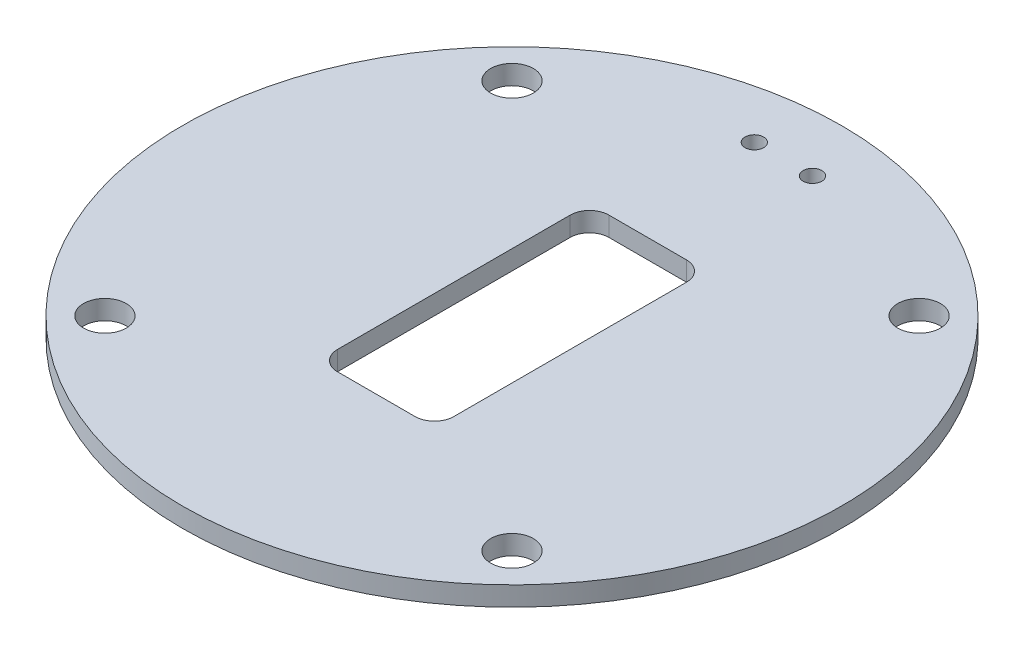
ISO-10303-21;
HEADER;
FILE_DESCRIPTION(('STEP AP214'),'2;1');
FILE_NAME('part.step','',(''),(''),'','','');
FILE_SCHEMA(('AUTOMOTIVE_DESIGN { 1 0 10303 214 1 1 1 1 }'));
ENDSEC;
DATA;
#1=APPLICATION_CONTEXT('core data for automotive mechanical design processes');
#2=APPLICATION_PROTOCOL_DEFINITION('international standard','automotive_design',2000,#1);
#3=PRODUCT_CONTEXT('',#1,'mechanical');
#4=PRODUCT('Part','Part','',(#3));
#5=PRODUCT_RELATED_PRODUCT_CATEGORY('part','',(#4));
#6=PRODUCT_DEFINITION_FORMATION('','',#4);
#7=PRODUCT_DEFINITION_CONTEXT('part definition',#1,'design');
#8=PRODUCT_DEFINITION('design','',#6,#7);
#9=PRODUCT_DEFINITION_SHAPE('','',#8);
#10=(LENGTH_UNIT() NAMED_UNIT(*) SI_UNIT(.MILLI.,.METRE.));
#11=(NAMED_UNIT(*) PLANE_ANGLE_UNIT() SI_UNIT($,.RADIAN.));
#12=(NAMED_UNIT(*) SI_UNIT($,.STERADIAN.) SOLID_ANGLE_UNIT());
#13=UNCERTAINTY_MEASURE_WITH_UNIT(LENGTH_MEASURE(1.E-05),#10,'distance_accuracy_value','');
#14=(GEOMETRIC_REPRESENTATION_CONTEXT(3) GLOBAL_UNCERTAINTY_ASSIGNED_CONTEXT((#13)) GLOBAL_UNIT_ASSIGNED_CONTEXT((#10,
#11,#12)) REPRESENTATION_CONTEXT('',''));
#15=CARTESIAN_POINT('',(0.,0.,0.));
#16=DIRECTION('',(0.,0.,1.));
#17=DIRECTION('',(1.,0.,0.));
#18=AXIS2_PLACEMENT_3D('',#15,#16,#17);
#19=CARTESIAN_POINT('',(0.,5.,0.));
#20=DIRECTION('',(0.,-1.,0.));
#21=DIRECTION('',(0.,0.,-1.));
#22=AXIS2_PLACEMENT_3D('',#19,#20,#21);
#23=CYLINDRICAL_SURFACE('',#22,85.);
#24=CARTESIAN_POINT('',(0.,5.,0.));
#25=DIRECTION('',(0.,1.,0.));
#26=DIRECTION('',(0.,0.,1.));
#27=AXIS2_PLACEMENT_3D('',#24,#25,#26);
#28=CIRCLE('',#27,85.);
#29=CARTESIAN_POINT('',(0.,5.,85.));
#30=VERTEX_POINT('',#29);
#31=EDGE_CURVE('E11',#30,#30,#28,.T.);
#32=ORIENTED_EDGE('',*,*,#31,.F.);
#33=EDGE_LOOP('',(#32));
#34=FACE_BOUND('',#33,.T.);
#35=CARTESIAN_POINT('',(0.,0.,0.));
#36=DIRECTION('',(0.,1.,0.));
#37=DIRECTION('',(0.,0.,1.));
#38=AXIS2_PLACEMENT_3D('',#35,#36,#37);
#39=CIRCLE('',#38,85.);
#40=CARTESIAN_POINT('',(0.,0.,85.));
#41=VERTEX_POINT('',#40);
#42=EDGE_CURVE('E37',#41,#41,#39,.T.);
#43=ORIENTED_EDGE('',*,*,#42,.T.);
#44=EDGE_LOOP('',(#43));
#45=FACE_BOUND('',#44,.T.);
#46=ADVANCED_FACE('F34',(#34,#45),#23,.T.);
#47=CARTESIAN_POINT('',(0.,5.,0.));
#48=DIRECTION('',(0.,1.,0.));
#49=DIRECTION('',(0.,0.,1.));
#50=AXIS2_PLACEMENT_3D('',#47,#48,#49);
#51=PLANE('',#50);
#52=CARTESIAN_POINT('',(7.5,5.,-70.));
#53=DIRECTION('',(0.,1.,0.));
#54=DIRECTION('',(0.,0.,1.));
#55=AXIS2_PLACEMENT_3D('',#52,#53,#54);
#56=CIRCLE('',#55,2.4);
#57=CARTESIAN_POINT('',(7.5,5.,-67.6));
#58=VERTEX_POINT('',#57);
#59=EDGE_CURVE('E376',#58,#58,#56,.T.);
#60=ORIENTED_EDGE('',*,*,#59,.F.);
#61=EDGE_LOOP('',(#60));
#62=FACE_BOUND('',#61,.T.);
#63=CARTESIAN_POINT('',(-7.5,5.,-70.));
#64=DIRECTION('',(0.,1.,0.));
#65=DIRECTION('',(0.,0.,-1.));
#66=AXIS2_PLACEMENT_3D('',#63,#64,#65);
#67=CIRCLE('',#66,2.4);
#68=CARTESIAN_POINT('',(-7.5,5.,-72.4));
#69=VERTEX_POINT('',#68);
#70=EDGE_CURVE('E395',#69,#69,#67,.T.);
#71=ORIENTED_EDGE('',*,*,#70,.F.);
#72=EDGE_LOOP('',(#71));
#73=FACE_BOUND('',#72,.T.);
#74=CARTESIAN_POINT('',(9.99999999999999,5.,-30.));
#75=DIRECTION('',(0.,1.,0.));
#76=DIRECTION('',(0.,0.,1.));
#77=AXIS2_PLACEMENT_3D('',#74,#75,#76);
#78=CIRCLE('',#77,5.);
#79=CARTESIAN_POINT('',(15.,5.,-30.));
#80=VERTEX_POINT('',#79);
#81=CARTESIAN_POINT('',(9.99999999999999,5.,-35.));
#82=VERTEX_POINT('',#81);
#83=EDGE_CURVE('E48',#80,#82,#78,.T.);
#84=ORIENTED_EDGE('',*,*,#83,.F.);
#85=DIRECTION('',(0.,0.,-1.));
#86=VECTOR('',#85,1.);
#87=CARTESIAN_POINT('',(15.,5.,30.));
#88=LINE('',#87,#86);
#89=CARTESIAN_POINT('',(15.,5.,30.));
#90=VERTEX_POINT('',#89);
#91=EDGE_CURVE('E106',#90,#80,#88,.T.);
#92=ORIENTED_EDGE('',*,*,#91,.F.);
#93=CARTESIAN_POINT('',(9.99999999999999,5.,30.));
#94=DIRECTION('',(0.,1.,0.));
#95=DIRECTION('',(0.,0.,1.));
#96=AXIS2_PLACEMENT_3D('',#93,#94,#95);
#97=CIRCLE('',#96,5.);
#98=CARTESIAN_POINT('',(9.99999999999999,5.,35.));
#99=VERTEX_POINT('',#98);
#100=EDGE_CURVE('E140',#99,#90,#97,.T.);
#101=ORIENTED_EDGE('',*,*,#100,.F.);
#102=DIRECTION('',(1.,0.,0.));
#103=VECTOR('',#102,1.);
#104=CARTESIAN_POINT('',(9.99999999999999,5.,35.));
#105=LINE('',#104,#103);
#106=CARTESIAN_POINT('',(-10.,5.,35.));
#107=VERTEX_POINT('',#106);
#108=EDGE_CURVE('E137',#107,#99,#105,.T.);
#109=ORIENTED_EDGE('',*,*,#108,.F.);
#110=CARTESIAN_POINT('',(-10.,5.,30.));
#111=DIRECTION('',(0.,1.,0.));
#112=DIRECTION('',(0.,0.,-1.));
#113=AXIS2_PLACEMENT_3D('',#110,#111,#112);
#114=CIRCLE('',#113,4.99999999999999);
#115=CARTESIAN_POINT('',(-15.,5.,30.));
#116=VERTEX_POINT('',#115);
#117=EDGE_CURVE('E134',#116,#107,#114,.T.);
#118=ORIENTED_EDGE('',*,*,#117,.F.);
#119=DIRECTION('',(0.,0.,1.));
#120=VECTOR('',#119,1.);
#121=CARTESIAN_POINT('',(-15.,5.,30.));
#122=LINE('',#121,#120);
#123=CARTESIAN_POINT('',(-15.,5.,-30.));
#124=VERTEX_POINT('',#123);
#125=EDGE_CURVE('E131',#124,#116,#122,.T.);
#126=ORIENTED_EDGE('',*,*,#125,.F.);
#127=CARTESIAN_POINT('',(-10.,5.,-30.));
#128=DIRECTION('',(0.,1.,0.));
#129=DIRECTION('',(0.,0.,1.));
#130=AXIS2_PLACEMENT_3D('',#127,#128,#129);
#131=CIRCLE('',#130,5.);
#132=CARTESIAN_POINT('',(-10.,5.,-35.));
#133=VERTEX_POINT('',#132);
#134=EDGE_CURVE('E128',#133,#124,#131,.T.);
#135=ORIENTED_EDGE('',*,*,#134,.F.);
#136=DIRECTION('',(-1.,0.,0.));
#137=VECTOR('',#136,1.);
#138=CARTESIAN_POINT('',(9.99999999999999,5.,-35.));
#139=LINE('',#138,#137);
#140=EDGE_CURVE('E121',#82,#133,#139,.T.);
#141=ORIENTED_EDGE('',*,*,#140,.F.);
#142=EDGE_LOOP('',(#84,#92,#101,#109,#118,#126,#135,#141));
#143=FACE_BOUND('',#142,.T.);
#144=CARTESIAN_POINT('',(-52.5,5.,-52.5));
#145=DIRECTION('',(0.,1.,0.));
#146=DIRECTION('',(0.,0.,-1.));
#147=AXIS2_PLACEMENT_3D('',#144,#145,#146);
#148=CIRCLE('',#147,5.5);
#149=CARTESIAN_POINT('',(-52.5,5.,-58.));
#150=VERTEX_POINT('',#149);
#151=EDGE_CURVE('E163',#150,#150,#148,.T.);
#152=ORIENTED_EDGE('',*,*,#151,.F.);
#153=EDGE_LOOP('',(#152));
#154=FACE_BOUND('',#153,.T.);
#155=CARTESIAN_POINT('',(52.5,5.,52.5));
#156=DIRECTION('',(0.,1.,0.));
#157=DIRECTION('',(0.,0.,-1.));
#158=AXIS2_PLACEMENT_3D('',#155,#156,#157);
#159=CIRCLE('',#158,5.5);
#160=CARTESIAN_POINT('',(52.5,5.,47.));
#161=VERTEX_POINT('',#160);
#162=EDGE_CURVE('E162',#161,#161,#159,.T.);
#163=ORIENTED_EDGE('',*,*,#162,.F.);
#164=EDGE_LOOP('',(#163));
#165=FACE_BOUND('',#164,.T.);
#166=CARTESIAN_POINT('',(-52.5,5.,52.5));
#167=DIRECTION('',(0.,1.,0.));
#168=DIRECTION('',(0.,0.,1.));
#169=AXIS2_PLACEMENT_3D('',#166,#167,#168);
#170=CIRCLE('',#169,5.5);
#171=CARTESIAN_POINT('',(-52.5,5.,58.));
#172=VERTEX_POINT('',#171);
#173=EDGE_CURVE('E112',#172,#172,#170,.T.);
#174=ORIENTED_EDGE('',*,*,#173,.F.);
#175=EDGE_LOOP('',(#174));
#176=FACE_BOUND('',#175,.T.);
#177=CARTESIAN_POINT('',(52.5,5.,-52.5));
#178=DIRECTION('',(0.,1.,0.));
#179=DIRECTION('',(0.,0.,1.));
#180=AXIS2_PLACEMENT_3D('',#177,#178,#179);
#181=CIRCLE('',#180,5.5);
#182=CARTESIAN_POINT('',(52.5,5.,-47.));
#183=VERTEX_POINT('',#182);
#184=EDGE_CURVE('E170',#183,#183,#181,.T.);
#185=ORIENTED_EDGE('',*,*,#184,.F.);
#186=EDGE_LOOP('',(#185));
#187=FACE_BOUND('',#186,.T.);
#188=ORIENTED_EDGE('',*,*,#31,.T.);
#189=EDGE_LOOP('',(#188));
#190=FACE_BOUND('',#189,.T.);
#191=ADVANCED_FACE('F187',(#62,#73,#143,#154,#165,#176,#187,#190),#51,.T.);
#192=CARTESIAN_POINT('',(0.,0.,0.));
#193=DIRECTION('',(0.,1.,0.));
#194=DIRECTION('',(0.,0.,1.));
#195=AXIS2_PLACEMENT_3D('',#192,#193,#194);
#196=PLANE('',#195);
#197=CARTESIAN_POINT('',(7.5,0.,-70.));
#198=DIRECTION('',(0.,1.,0.));
#199=DIRECTION('',(0.,0.,1.));
#200=AXIS2_PLACEMENT_3D('',#197,#198,#199);
#201=CIRCLE('',#200,2.4);
#202=CARTESIAN_POINT('',(7.5,0.,-67.6));
#203=VERTEX_POINT('',#202);
#204=EDGE_CURVE('E374',#203,#203,#201,.F.);
#205=ORIENTED_EDGE('',*,*,#204,.F.);
#206=EDGE_LOOP('',(#205));
#207=FACE_BOUND('',#206,.T.);
#208=CARTESIAN_POINT('',(-7.5,0.,-70.));
#209=DIRECTION('',(0.,1.,0.));
#210=DIRECTION('',(0.,0.,1.));
#211=AXIS2_PLACEMENT_3D('',#208,#209,#210);
#212=CIRCLE('',#211,2.4);
#213=CARTESIAN_POINT('',(-7.5,0.,-67.6));
#214=VERTEX_POINT('',#213);
#215=EDGE_CURVE('E379',#214,#214,#212,.F.);
#216=ORIENTED_EDGE('',*,*,#215,.F.);
#217=EDGE_LOOP('',(#216));
#218=FACE_BOUND('',#217,.T.);
#219=DIRECTION('',(0.,0.,1.));
#220=VECTOR('',#219,1.);
#221=CARTESIAN_POINT('',(15.,0.,30.));
#222=LINE('',#221,#220);
#223=CARTESIAN_POINT('',(15.,0.,-30.));
#224=VERTEX_POINT('',#223);
#225=CARTESIAN_POINT('',(15.,0.,30.));
#226=VERTEX_POINT('',#225);
#227=EDGE_CURVE('E119',#224,#226,#222,.T.);
#228=ORIENTED_EDGE('',*,*,#227,.F.);
#229=CARTESIAN_POINT('',(9.99999999999999,0.,-30.));
#230=DIRECTION('',(0.,1.,0.));
#231=DIRECTION('',(0.,0.,1.));
#232=AXIS2_PLACEMENT_3D('',#229,#230,#231);
#233=CIRCLE('',#232,5.);
#234=CARTESIAN_POINT('',(9.99999999999999,0.,-35.));
#235=VERTEX_POINT('',#234);
#236=EDGE_CURVE('E100',#235,#224,#233,.F.);
#237=ORIENTED_EDGE('',*,*,#236,.F.);
#238=DIRECTION('',(1.,0.,0.));
#239=VECTOR('',#238,1.);
#240=CARTESIAN_POINT('',(9.99999999999999,0.,-35.));
#241=LINE('',#240,#239);
#242=CARTESIAN_POINT('',(-10.,0.,-35.));
#243=VERTEX_POINT('',#242);
#244=EDGE_CURVE('E109',#243,#235,#241,.T.);
#245=ORIENTED_EDGE('',*,*,#244,.F.);
#246=CARTESIAN_POINT('',(-10.,0.,-30.));
#247=DIRECTION('',(0.,1.,0.));
#248=DIRECTION('',(0.,0.,1.));
#249=AXIS2_PLACEMENT_3D('',#246,#247,#248);
#250=CIRCLE('',#249,5.);
#251=CARTESIAN_POINT('',(-15.,0.,-30.));
#252=VERTEX_POINT('',#251);
#253=EDGE_CURVE('E56',#252,#243,#250,.F.);
#254=ORIENTED_EDGE('',*,*,#253,.F.);
#255=DIRECTION('',(0.,0.,-1.));
#256=VECTOR('',#255,1.);
#257=CARTESIAN_POINT('',(-15.,0.,30.));
#258=LINE('',#257,#256);
#259=CARTESIAN_POINT('',(-15.,0.,30.));
#260=VERTEX_POINT('',#259);
#261=EDGE_CURVE('E369',#260,#252,#258,.T.);
#262=ORIENTED_EDGE('',*,*,#261,.F.);
#263=CARTESIAN_POINT('',(-10.,0.,30.));
#264=DIRECTION('',(0.,1.,0.));
#265=DIRECTION('',(0.,0.,1.));
#266=AXIS2_PLACEMENT_3D('',#263,#264,#265);
#267=CIRCLE('',#266,4.99999999999999);
#268=CARTESIAN_POINT('',(-10.,0.,35.));
#269=VERTEX_POINT('',#268);
#270=EDGE_CURVE('E372',#269,#260,#267,.F.);
#271=ORIENTED_EDGE('',*,*,#270,.F.);
#272=DIRECTION('',(-1.,0.,0.));
#273=VECTOR('',#272,1.);
#274=CARTESIAN_POINT('',(9.99999999999999,0.,35.));
#275=LINE('',#274,#273);
#276=CARTESIAN_POINT('',(9.99999999999999,0.,35.));
#277=VERTEX_POINT('',#276);
#278=EDGE_CURVE('E383',#277,#269,#275,.T.);
#279=ORIENTED_EDGE('',*,*,#278,.F.);
#280=CARTESIAN_POINT('',(9.99999999999999,0.,30.));
#281=DIRECTION('',(0.,1.,0.));
#282=DIRECTION('',(0.,0.,1.));
#283=AXIS2_PLACEMENT_3D('',#280,#281,#282);
#284=CIRCLE('',#283,5.);
#285=EDGE_CURVE('E123',#226,#277,#284,.F.);
#286=ORIENTED_EDGE('',*,*,#285,.F.);
#287=EDGE_LOOP('',(#228,#237,#245,#254,#262,#271,#279,#286));
#288=FACE_BOUND('',#287,.T.);
#289=CARTESIAN_POINT('',(-52.5,0.,-52.5));
#290=DIRECTION('',(0.,1.,0.));
#291=DIRECTION('',(0.,0.,1.));
#292=AXIS2_PLACEMENT_3D('',#289,#290,#291);
#293=CIRCLE('',#292,5.5);
#294=CARTESIAN_POINT('',(-52.5,0.,-47.));
#295=VERTEX_POINT('',#294);
#296=EDGE_CURVE('E166',#295,#295,#293,.F.);
#297=ORIENTED_EDGE('',*,*,#296,.F.);
#298=EDGE_LOOP('',(#297));
#299=FACE_BOUND('',#298,.T.);
#300=CARTESIAN_POINT('',(52.5,0.,52.5));
#301=DIRECTION('',(0.,1.,0.));
#302=DIRECTION('',(0.,0.,1.));
#303=AXIS2_PLACEMENT_3D('',#300,#301,#302);
#304=CIRCLE('',#303,5.5);
#305=CARTESIAN_POINT('',(52.5,0.,58.));
#306=VERTEX_POINT('',#305);
#307=EDGE_CURVE('E167',#306,#306,#304,.F.);
#308=ORIENTED_EDGE('',*,*,#307,.F.);
#309=EDGE_LOOP('',(#308));
#310=FACE_BOUND('',#309,.T.);
#311=CARTESIAN_POINT('',(-52.5,0.,52.5));
#312=DIRECTION('',(0.,1.,0.));
#313=DIRECTION('',(0.,0.,1.));
#314=AXIS2_PLACEMENT_3D('',#311,#312,#313);
#315=CIRCLE('',#314,5.5);
#316=CARTESIAN_POINT('',(-52.5,0.,58.));
#317=VERTEX_POINT('',#316);
#318=EDGE_CURVE('E159',#317,#317,#315,.F.);
#319=ORIENTED_EDGE('',*,*,#318,.F.);
#320=EDGE_LOOP('',(#319));
#321=FACE_BOUND('',#320,.T.);
#322=CARTESIAN_POINT('',(52.5,0.,-52.5));
#323=DIRECTION('',(0.,1.,0.));
#324=DIRECTION('',(0.,0.,1.));
#325=AXIS2_PLACEMENT_3D('',#322,#323,#324);
#326=CIRCLE('',#325,5.5);
#327=CARTESIAN_POINT('',(52.5,0.,-47.));
#328=VERTEX_POINT('',#327);
#329=EDGE_CURVE('E177',#328,#328,#326,.F.);
#330=ORIENTED_EDGE('',*,*,#329,.F.);
#331=EDGE_LOOP('',(#330));
#332=FACE_BOUND('',#331,.T.);
#333=ORIENTED_EDGE('',*,*,#42,.F.);
#334=EDGE_LOOP('',(#333));
#335=FACE_BOUND('',#334,.T.);
#336=ADVANCED_FACE('F115',(#207,#218,#288,#299,#310,#321,#332,#335),#196,.F.);
#337=CARTESIAN_POINT('',(52.5,-0.00100000000000013,-52.5));
#338=DIRECTION('',(0.,1.,0.));
#339=DIRECTION('',(0.,0.,1.));
#340=AXIS2_PLACEMENT_3D('',#337,#338,#339);
#341=CYLINDRICAL_SURFACE('',#340,5.5);
#342=ORIENTED_EDGE('',*,*,#184,.T.);
#343=EDGE_LOOP('',(#342));
#344=FACE_BOUND('',#343,.T.);
#345=ORIENTED_EDGE('',*,*,#329,.T.);
#346=EDGE_LOOP('',(#345));
#347=FACE_BOUND('',#346,.T.);
#348=ADVANCED_FACE('F186',(#344,#347),#341,.F.);
#349=CARTESIAN_POINT('',(-52.5,-0.00100000000000013,52.5));
#350=DIRECTION('',(0.,1.,0.));
#351=DIRECTION('',(0.,0.,1.));
#352=AXIS2_PLACEMENT_3D('',#349,#350,#351);
#353=CYLINDRICAL_SURFACE('',#352,5.5);
#354=ORIENTED_EDGE('',*,*,#173,.T.);
#355=EDGE_LOOP('',(#354));
#356=FACE_BOUND('',#355,.T.);
#357=ORIENTED_EDGE('',*,*,#318,.T.);
#358=EDGE_LOOP('',(#357));
#359=FACE_BOUND('',#358,.T.);
#360=ADVANCED_FACE('F193',(#356,#359),#353,.F.);
#361=CARTESIAN_POINT('',(52.5,-0.00100000000000013,52.5));
#362=DIRECTION('',(0.,1.,0.));
#363=DIRECTION('',(0.,0.,1.));
#364=AXIS2_PLACEMENT_3D('',#361,#362,#363);
#365=CYLINDRICAL_SURFACE('',#364,5.5);
#366=ORIENTED_EDGE('',*,*,#162,.T.);
#367=EDGE_LOOP('',(#366));
#368=FACE_BOUND('',#367,.T.);
#369=ORIENTED_EDGE('',*,*,#307,.T.);
#370=EDGE_LOOP('',(#369));
#371=FACE_BOUND('',#370,.T.);
#372=ADVANCED_FACE('F277',(#368,#371),#365,.F.);
#373=CARTESIAN_POINT('',(-52.5,-0.00100000000000013,-52.5));
#374=DIRECTION('',(0.,1.,0.));
#375=DIRECTION('',(0.,0.,1.));
#376=AXIS2_PLACEMENT_3D('',#373,#374,#375);
#377=CYLINDRICAL_SURFACE('',#376,5.5);
#378=ORIENTED_EDGE('',*,*,#151,.T.);
#379=EDGE_LOOP('',(#378));
#380=FACE_BOUND('',#379,.T.);
#381=ORIENTED_EDGE('',*,*,#296,.T.);
#382=EDGE_LOOP('',(#381));
#383=FACE_BOUND('',#382,.T.);
#384=ADVANCED_FACE('F274',(#380,#383),#377,.F.);
#385=CARTESIAN_POINT('',(9.99999999999999,-0.00100000000000013,-30.));
#386=DIRECTION('',(0.,1.,0.));
#387=DIRECTION('',(0.,0.,1.));
#388=AXIS2_PLACEMENT_3D('',#385,#386,#387);
#389=CYLINDRICAL_SURFACE('',#388,5.);
#390=ORIENTED_EDGE('',*,*,#236,.T.);
#391=DIRECTION('',(0.,1.,0.));
#392=VECTOR('',#391,1.);
#393=CARTESIAN_POINT('',(15.,-0.00100000000000013,-30.));
#394=LINE('',#393,#392);
#395=EDGE_CURVE('E113',#224,#80,#394,.T.);
#396=ORIENTED_EDGE('',*,*,#395,.T.);
#397=ORIENTED_EDGE('',*,*,#83,.T.);
#398=DIRECTION('',(0.,1.,0.));
#399=VECTOR('',#398,1.);
#400=CARTESIAN_POINT('',(9.99999999999999,-0.00100000000000013,-35.));
#401=LINE('',#400,#399);
#402=EDGE_CURVE('E96',#235,#82,#401,.T.);
#403=ORIENTED_EDGE('',*,*,#402,.F.);
#404=EDGE_LOOP('',(#390,#396,#397,#403));
#405=FACE_BOUND('',#404,.T.);
#406=ADVANCED_FACE('F98',(#405),#389,.F.);
#407=CARTESIAN_POINT('',(15.,-0.00100000000000013,30.));
#408=DIRECTION('',(1.,0.,0.));
#409=DIRECTION('',(0.,0.,-1.));
#410=AXIS2_PLACEMENT_3D('',#407,#408,#409);
#411=PLANE('',#410);
#412=ORIENTED_EDGE('',*,*,#227,.T.);
#413=DIRECTION('',(0.,1.,0.));
#414=VECTOR('',#413,1.);
#415=CARTESIAN_POINT('',(15.,-0.00100000000000013,30.));
#416=LINE('',#415,#414);
#417=EDGE_CURVE('E146',#226,#90,#416,.T.);
#418=ORIENTED_EDGE('',*,*,#417,.T.);
#419=ORIENTED_EDGE('',*,*,#91,.T.);
#420=ORIENTED_EDGE('',*,*,#395,.F.);
#421=EDGE_LOOP('',(#412,#418,#419,#420));
#422=FACE_BOUND('',#421,.T.);
#423=ADVANCED_FACE('F248',(#422),#411,.F.);
#424=CARTESIAN_POINT('',(9.99999999999999,-0.00100000000000013,30.));
#425=DIRECTION('',(0.,1.,0.));
#426=DIRECTION('',(0.,0.,1.));
#427=AXIS2_PLACEMENT_3D('',#424,#425,#426);
#428=CYLINDRICAL_SURFACE('',#427,5.);
#429=ORIENTED_EDGE('',*,*,#285,.T.);
#430=DIRECTION('',(0.,1.,0.));
#431=VECTOR('',#430,1.);
#432=CARTESIAN_POINT('',(9.99999999999999,-0.00100000000000013,35.));
#433=LINE('',#432,#431);
#434=EDGE_CURVE('E148',#277,#99,#433,.T.);
#435=ORIENTED_EDGE('',*,*,#434,.T.);
#436=ORIENTED_EDGE('',*,*,#100,.T.);
#437=ORIENTED_EDGE('',*,*,#417,.F.);
#438=EDGE_LOOP('',(#429,#435,#436,#437));
#439=FACE_BOUND('',#438,.T.);
#440=ADVANCED_FACE('F251',(#439),#428,.F.);
#441=CARTESIAN_POINT('',(9.99999999999999,-0.00100000000000013,35.));
#442=DIRECTION('',(0.,0.,1.));
#443=DIRECTION('',(1.,0.,0.));
#444=AXIS2_PLACEMENT_3D('',#441,#442,#443);
#445=PLANE('',#444);
#446=ORIENTED_EDGE('',*,*,#278,.T.);
#447=DIRECTION('',(0.,1.,0.));
#448=VECTOR('',#447,1.);
#449=CARTESIAN_POINT('',(-10.,-0.00100000000000013,35.));
#450=LINE('',#449,#448);
#451=EDGE_CURVE('E150',#269,#107,#450,.T.);
#452=ORIENTED_EDGE('',*,*,#451,.T.);
#453=ORIENTED_EDGE('',*,*,#108,.T.);
#454=ORIENTED_EDGE('',*,*,#434,.F.);
#455=EDGE_LOOP('',(#446,#452,#453,#454));
#456=FACE_BOUND('',#455,.T.);
#457=ADVANCED_FACE('F255',(#456),#445,.F.);
#458=CARTESIAN_POINT('',(-10.,-0.00100000000000013,30.));
#459=DIRECTION('',(0.,1.,0.));
#460=DIRECTION('',(0.,0.,1.));
#461=AXIS2_PLACEMENT_3D('',#458,#459,#460);
#462=CYLINDRICAL_SURFACE('',#461,4.99999999999999);
#463=ORIENTED_EDGE('',*,*,#270,.T.);
#464=DIRECTION('',(0.,1.,0.));
#465=VECTOR('',#464,1.);
#466=CARTESIAN_POINT('',(-15.,-0.00100000000000013,30.));
#467=LINE('',#466,#465);
#468=EDGE_CURVE('E152',#260,#116,#467,.T.);
#469=ORIENTED_EDGE('',*,*,#468,.T.);
#470=ORIENTED_EDGE('',*,*,#117,.T.);
#471=ORIENTED_EDGE('',*,*,#451,.F.);
#472=EDGE_LOOP('',(#463,#469,#470,#471));
#473=FACE_BOUND('',#472,.T.);
#474=ADVANCED_FACE('F259',(#473),#462,.F.);
#475=CARTESIAN_POINT('',(-15.,-0.00100000000000013,30.));
#476=DIRECTION('',(-1.,0.,0.));
#477=DIRECTION('',(0.,0.,1.));
#478=AXIS2_PLACEMENT_3D('',#475,#476,#477);
#479=PLANE('',#478);
#480=ORIENTED_EDGE('',*,*,#261,.T.);
#481=DIRECTION('',(0.,1.,0.));
#482=VECTOR('',#481,1.);
#483=CARTESIAN_POINT('',(-15.,-0.00100000000000013,-30.));
#484=LINE('',#483,#482);
#485=EDGE_CURVE('E154',#252,#124,#484,.T.);
#486=ORIENTED_EDGE('',*,*,#485,.T.);
#487=ORIENTED_EDGE('',*,*,#125,.T.);
#488=ORIENTED_EDGE('',*,*,#468,.F.);
#489=EDGE_LOOP('',(#480,#486,#487,#488));
#490=FACE_BOUND('',#489,.T.);
#491=ADVANCED_FACE('F263',(#490),#479,.F.);
#492=CARTESIAN_POINT('',(-10.,-0.00100000000000013,-30.));
#493=DIRECTION('',(0.,1.,0.));
#494=DIRECTION('',(0.,0.,1.));
#495=AXIS2_PLACEMENT_3D('',#492,#493,#494);
#496=CYLINDRICAL_SURFACE('',#495,5.);
#497=ORIENTED_EDGE('',*,*,#253,.T.);
#498=DIRECTION('',(0.,1.,0.));
#499=VECTOR('',#498,1.);
#500=CARTESIAN_POINT('',(-10.,-0.00100000000000013,-35.));
#501=LINE('',#500,#499);
#502=EDGE_CURVE('E105',#243,#133,#501,.T.);
#503=ORIENTED_EDGE('',*,*,#502,.T.);
#504=ORIENTED_EDGE('',*,*,#134,.T.);
#505=ORIENTED_EDGE('',*,*,#485,.F.);
#506=EDGE_LOOP('',(#497,#503,#504,#505));
#507=FACE_BOUND('',#506,.T.);
#508=ADVANCED_FACE('F267',(#507),#496,.F.);
#509=CARTESIAN_POINT('',(9.99999999999999,-0.00100000000000013,-35.));
#510=DIRECTION('',(0.,0.,-1.));
#511=DIRECTION('',(-1.,0.,0.));
#512=AXIS2_PLACEMENT_3D('',#509,#510,#511);
#513=PLANE('',#512);
#514=ORIENTED_EDGE('',*,*,#244,.T.);
#515=ORIENTED_EDGE('',*,*,#402,.T.);
#516=ORIENTED_EDGE('',*,*,#140,.T.);
#517=ORIENTED_EDGE('',*,*,#502,.F.);
#518=EDGE_LOOP('',(#514,#515,#516,#517));
#519=FACE_BOUND('',#518,.T.);
#520=ADVANCED_FACE('F110',(#519),#513,.F.);
#521=CARTESIAN_POINT('',(-7.5,-6.78822509939085,-70.));
#522=DIRECTION('',(0.,1.,0.));
#523=DIRECTION('',(0.,0.,1.));
#524=AXIS2_PLACEMENT_3D('',#521,#522,#523);
#525=CYLINDRICAL_SURFACE('',#524,2.4);
#526=ORIENTED_EDGE('',*,*,#215,.T.);
#527=EDGE_LOOP('',(#526));
#528=FACE_BOUND('',#527,.T.);
#529=ORIENTED_EDGE('',*,*,#70,.T.);
#530=EDGE_LOOP('',(#529));
#531=FACE_BOUND('',#530,.T.);
#532=ADVANCED_FACE('F226',(#528,#531),#525,.F.);
#533=CARTESIAN_POINT('',(7.5,-6.78822509939085,-70.));
#534=DIRECTION('',(0.,1.,0.));
#535=DIRECTION('',(0.,0.,1.));
#536=AXIS2_PLACEMENT_3D('',#533,#534,#535);
#537=CYLINDRICAL_SURFACE('',#536,2.4);
#538=ORIENTED_EDGE('',*,*,#204,.T.);
#539=EDGE_LOOP('',(#538));
#540=FACE_BOUND('',#539,.T.);
#541=ORIENTED_EDGE('',*,*,#59,.T.);
#542=EDGE_LOOP('',(#541));
#543=FACE_BOUND('',#542,.T.);
#544=ADVANCED_FACE('F231',(#540,#543),#537,.F.);
#545=CLOSED_SHELL('',(#46,#191,#336,#348,#360,#372,#384,#406,#423,#440,#457,#474,#491,#508,#520,
#532,#544));
#546=MANIFOLD_SOLID_BREP('B2',#545);
#547=ADVANCED_BREP_SHAPE_REPRESENTATION('',(#18,#546),#14);
#548=SHAPE_DEFINITION_REPRESENTATION(#9,#547);
ENDSEC;
END-ISO-10303-21;
